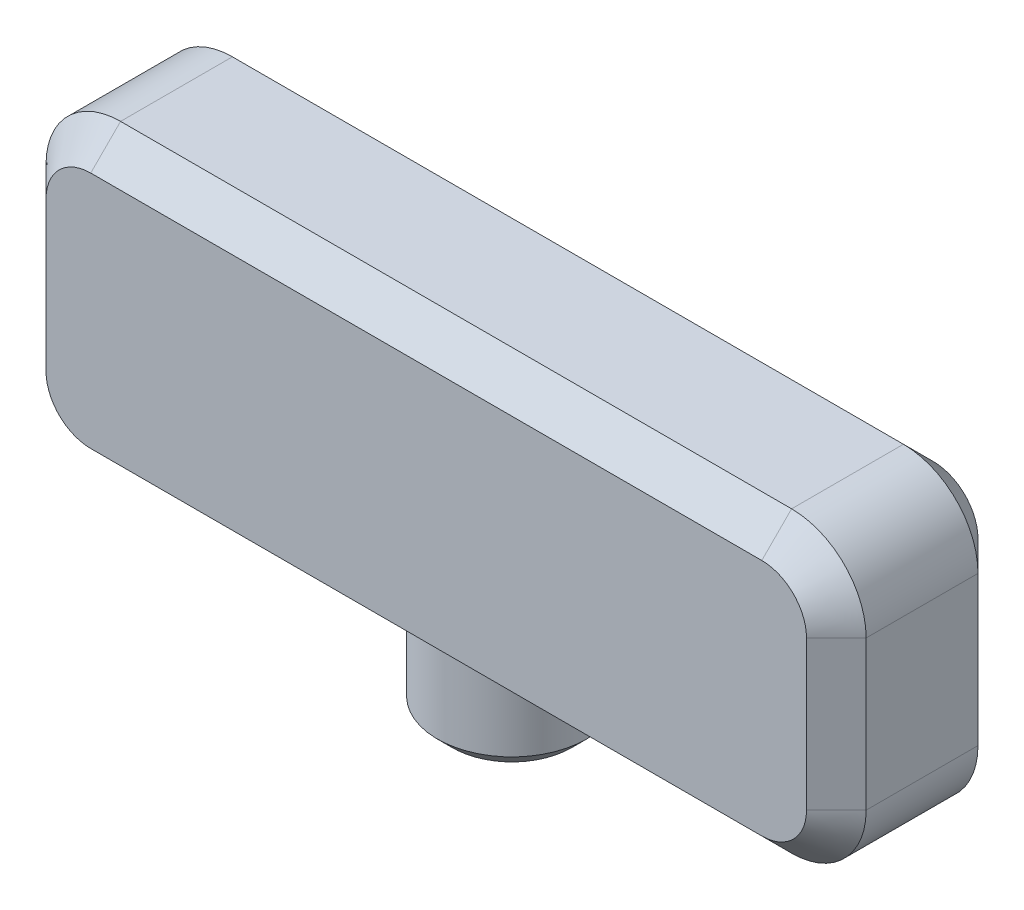
ISO-10303-21;
HEADER;
FILE_DESCRIPTION(('STEP AP214'),'2;1');
FILE_NAME('part.step','',(''),(''),'','','');
FILE_SCHEMA(('AUTOMOTIVE_DESIGN { 1 0 10303 214 1 1 1 1 }'));
ENDSEC;
DATA;
#1=APPLICATION_CONTEXT('core data for automotive mechanical design processes');
#2=APPLICATION_PROTOCOL_DEFINITION('international standard','automotive_design',2000,#1);
#3=PRODUCT_CONTEXT('',#1,'mechanical');
#4=PRODUCT('Part','Part','',(#3));
#5=PRODUCT_RELATED_PRODUCT_CATEGORY('part','',(#4));
#6=PRODUCT_DEFINITION_FORMATION('','',#4);
#7=PRODUCT_DEFINITION_CONTEXT('part definition',#1,'design');
#8=PRODUCT_DEFINITION('design','',#6,#7);
#9=PRODUCT_DEFINITION_SHAPE('','',#8);
#10=(LENGTH_UNIT() NAMED_UNIT(*) SI_UNIT(.MILLI.,.METRE.));
#11=(NAMED_UNIT(*) PLANE_ANGLE_UNIT() SI_UNIT($,.RADIAN.));
#12=(NAMED_UNIT(*) SI_UNIT($,.STERADIAN.) SOLID_ANGLE_UNIT());
#13=UNCERTAINTY_MEASURE_WITH_UNIT(LENGTH_MEASURE(1.E-05),#10,'distance_accuracy_value','');
#14=(GEOMETRIC_REPRESENTATION_CONTEXT(3) GLOBAL_UNCERTAINTY_ASSIGNED_CONTEXT((#13)) GLOBAL_UNIT_ASSIGNED_CONTEXT((#10,
#11,#12)) REPRESENTATION_CONTEXT('',''));
#15=CARTESIAN_POINT('',(0.,0.,0.));
#16=DIRECTION('',(0.,0.,1.));
#17=DIRECTION('',(1.,0.,0.));
#18=AXIS2_PLACEMENT_3D('',#15,#16,#17);
#19=CARTESIAN_POINT('',(0.,-25.4,22.86));
#20=DIRECTION('',(0.,-1.,0.));
#21=DIRECTION('',(1.,0.,0.));
#22=AXIS2_PLACEMENT_3D('',#19,#20,#21);
#23=PLANE('',#22);
#24=CARTESIAN_POINT('',(0.,-25.4,14.605));
#25=DIRECTION('',(0.,-1.,0.));
#26=DIRECTION('',(1.,0.,0.));
#27=AXIS2_PLACEMENT_3D('',#24,#25,#26);
#28=CIRCLE('',#27,12.7);
#29=CARTESIAN_POINT('',(-8.40026041263012,-25.4,24.13));
#30=VERTEX_POINT('',#29);
#31=CARTESIAN_POINT('',(-8.40026041263009,-25.4,5.08));
#32=VERTEX_POINT('',#31);
#33=EDGE_CURVE('E31',#30,#32,#28,.T.);
#34=ORIENTED_EDGE('',*,*,#33,.F.);
#35=DIRECTION('',(-1.,0.,0.));
#36=VECTOR('',#35,1.);
#37=CARTESIAN_POINT('',(0.,-25.4,24.13));
#38=LINE('',#37,#36);
#39=CARTESIAN_POINT('',(-57.15,-25.4,24.13));
#40=VERTEX_POINT('',#39);
#41=EDGE_CURVE('E261',#30,#40,#38,.T.);
#42=ORIENTED_EDGE('',*,*,#41,.T.);
#43=DIRECTION('',(0.,0.,-1.));
#44=VECTOR('',#43,1.);
#45=CARTESIAN_POINT('',(-57.15,-25.4,22.86));
#46=LINE('',#45,#44);
#47=CARTESIAN_POINT('',(-57.15,-25.4,5.08));
#48=VERTEX_POINT('',#47);
#49=EDGE_CURVE('E318',#40,#48,#46,.T.);
#50=ORIENTED_EDGE('',*,*,#49,.T.);
#51=DIRECTION('',(1.,0.,0.));
#52=VECTOR('',#51,1.);
#53=CARTESIAN_POINT('',(57.15,-25.4,5.08));
#54=LINE('',#53,#52);
#55=EDGE_CURVE('E154',#48,#32,#54,.T.);
#56=ORIENTED_EDGE('',*,*,#55,.T.);
#57=EDGE_LOOP('',(#34,#42,#50,#56));
#58=FACE_BOUND('',#57,.T.);
#59=ADVANCED_FACE('F16',(#58),#23,.T.);
#60=CARTESIAN_POINT('',(-69.85,0.,22.86));
#61=DIRECTION('',(-1.,0.,0.));
#62=DIRECTION('',(0.,0.,1.));
#63=AXIS2_PLACEMENT_3D('',#60,#61,#62);
#64=PLANE('',#63);
#65=DIRECTION('',(0.,0.,-1.));
#66=VECTOR('',#65,1.);
#67=CARTESIAN_POINT('',(-69.85,-12.7,22.86));
#68=LINE('',#67,#66);
#69=CARTESIAN_POINT('',(-69.85,-12.7,5.08));
#70=VERTEX_POINT('',#69);
#71=CARTESIAN_POINT('',(-69.85,-12.7,24.13));
#72=VERTEX_POINT('',#71);
#73=EDGE_CURVE('E312',#70,#72,#68,.F.);
#74=ORIENTED_EDGE('',*,*,#73,.T.);
#75=DIRECTION('',(0.,1.,0.));
#76=VECTOR('',#75,1.);
#77=CARTESIAN_POINT('',(-69.85,0.,24.13));
#78=LINE('',#77,#76);
#79=CARTESIAN_POINT('',(-69.85,12.7,24.13));
#80=VERTEX_POINT('',#79);
#81=EDGE_CURVE('E253',#72,#80,#78,.T.);
#82=ORIENTED_EDGE('',*,*,#81,.T.);
#83=DIRECTION('',(0.,0.,-1.));
#84=VECTOR('',#83,1.);
#85=CARTESIAN_POINT('',(-69.85,12.7,0.));
#86=LINE('',#85,#84);
#87=CARTESIAN_POINT('',(-69.85,12.7,5.08));
#88=VERTEX_POINT('',#87);
#89=EDGE_CURVE('E315',#80,#88,#86,.T.);
#90=ORIENTED_EDGE('',*,*,#89,.T.);
#91=DIRECTION('',(0.,-1.,0.));
#92=VECTOR('',#91,1.);
#93=CARTESIAN_POINT('',(-69.85,-12.7,5.08));
#94=LINE('',#93,#92);
#95=EDGE_CURVE('E255',#88,#70,#94,.T.);
#96=ORIENTED_EDGE('',*,*,#95,.T.);
#97=EDGE_LOOP('',(#74,#82,#90,#96));
#98=FACE_BOUND('',#97,.T.);
#99=ADVANCED_FACE('F360',(#98),#64,.T.);
#100=CARTESIAN_POINT('',(8.40026041263009,-25.4,5.08));
#101=VERTEX_POINT('',#100);
#102=CARTESIAN_POINT('',(8.40026041263012,-25.4,24.13));
#103=VERTEX_POINT('',#102);
#104=EDGE_CURVE('E158',#101,#103,#28,.T.);
#105=ORIENTED_EDGE('',*,*,#104,.F.);
#106=CARTESIAN_POINT('',(57.15,-25.4,5.08));
#107=VERTEX_POINT('',#106);
#108=EDGE_CURVE('E142',#101,#107,#54,.T.);
#109=ORIENTED_EDGE('',*,*,#108,.T.);
#110=DIRECTION('',(0.,0.,-1.));
#111=VECTOR('',#110,1.);
#112=CARTESIAN_POINT('',(57.15,-25.4,29.21));
#113=LINE('',#112,#111);
#114=CARTESIAN_POINT('',(57.15,-25.4,24.13));
#115=VERTEX_POINT('',#114);
#116=EDGE_CURVE('E321',#107,#115,#113,.F.);
#117=ORIENTED_EDGE('',*,*,#116,.T.);
#118=EDGE_CURVE('E160',#115,#103,#38,.T.);
#119=ORIENTED_EDGE('',*,*,#118,.T.);
#120=EDGE_LOOP('',(#105,#109,#117,#119));
#121=FACE_BOUND('',#120,.T.);
#122=ADVANCED_FACE('F159',(#121),#23,.T.);
#123=CARTESIAN_POINT('',(69.85,0.,22.86));
#124=DIRECTION('',(-1.,0.,0.));
#125=DIRECTION('',(0.,-1.,0.));
#126=AXIS2_PLACEMENT_3D('',#123,#124,#125);
#127=PLANE('',#126);
#128=DIRECTION('',(0.,0.,-1.));
#129=VECTOR('',#128,1.);
#130=CARTESIAN_POINT('',(69.85,12.7,22.86));
#131=LINE('',#130,#129);
#132=CARTESIAN_POINT('',(69.85,12.7,5.08));
#133=VERTEX_POINT('',#132);
#134=CARTESIAN_POINT('',(69.85,12.7,24.13));
#135=VERTEX_POINT('',#134);
#136=EDGE_CURVE('E309',#133,#135,#131,.F.);
#137=ORIENTED_EDGE('',*,*,#136,.T.);
#138=DIRECTION('',(0.,-1.,0.));
#139=VECTOR('',#138,1.);
#140=CARTESIAN_POINT('',(69.85,-12.7,24.13));
#141=LINE('',#140,#139);
#142=CARTESIAN_POINT('',(69.85,-12.7,24.13));
#143=VERTEX_POINT('',#142);
#144=EDGE_CURVE('E266',#135,#143,#141,.T.);
#145=ORIENTED_EDGE('',*,*,#144,.T.);
#146=DIRECTION('',(0.,0.,-1.));
#147=VECTOR('',#146,1.);
#148=CARTESIAN_POINT('',(69.85,-12.7,0.));
#149=LINE('',#148,#147);
#150=CARTESIAN_POINT('',(69.85,-12.7,5.08));
#151=VERTEX_POINT('',#150);
#152=EDGE_CURVE('E306',#143,#151,#149,.T.);
#153=ORIENTED_EDGE('',*,*,#152,.T.);
#154=DIRECTION('',(0.,1.,0.));
#155=VECTOR('',#154,1.);
#156=CARTESIAN_POINT('',(69.85,0.,5.08));
#157=LINE('',#156,#155);
#158=EDGE_CURVE('E268',#151,#133,#157,.T.);
#159=ORIENTED_EDGE('',*,*,#158,.T.);
#160=EDGE_LOOP('',(#137,#145,#153,#159));
#161=FACE_BOUND('',#160,.T.);
#162=ADVANCED_FACE('F370',(#161),#127,.F.);
#163=CARTESIAN_POINT('',(0.,25.4,22.86));
#164=DIRECTION('',(0.,-1.,0.));
#165=DIRECTION('',(1.,0.,0.));
#166=AXIS2_PLACEMENT_3D('',#163,#164,#165);
#167=PLANE('',#166);
#168=DIRECTION('',(0.,0.,-1.));
#169=VECTOR('',#168,1.);
#170=CARTESIAN_POINT('',(-57.15,25.4,29.21));
#171=LINE('',#170,#169);
#172=CARTESIAN_POINT('',(-57.15,25.4,5.08));
#173=VERTEX_POINT('',#172);
#174=CARTESIAN_POINT('',(-57.15,25.4,24.13));
#175=VERTEX_POINT('',#174);
#176=EDGE_CURVE('E303',#173,#175,#171,.F.);
#177=ORIENTED_EDGE('',*,*,#176,.T.);
#178=DIRECTION('',(1.,0.,0.));
#179=VECTOR('',#178,1.);
#180=CARTESIAN_POINT('',(57.15,25.4,24.13));
#181=LINE('',#180,#179);
#182=CARTESIAN_POINT('',(57.15,25.4,24.13));
#183=VERTEX_POINT('',#182);
#184=EDGE_CURVE('E274',#175,#183,#181,.T.);
#185=ORIENTED_EDGE('',*,*,#184,.T.);
#186=DIRECTION('',(0.,0.,-1.));
#187=VECTOR('',#186,1.);
#188=CARTESIAN_POINT('',(57.15,25.4,22.86));
#189=LINE('',#188,#187);
#190=CARTESIAN_POINT('',(57.15,25.4,5.08));
#191=VERTEX_POINT('',#190);
#192=EDGE_CURVE('E300',#183,#191,#189,.T.);
#193=ORIENTED_EDGE('',*,*,#192,.T.);
#194=DIRECTION('',(-1.,0.,0.));
#195=VECTOR('',#194,1.);
#196=CARTESIAN_POINT('',(0.,25.4,5.08));
#197=LINE('',#196,#195);
#198=EDGE_CURVE('E276',#191,#173,#197,.T.);
#199=ORIENTED_EDGE('',*,*,#198,.T.);
#200=EDGE_LOOP('',(#177,#185,#193,#199));
#201=FACE_BOUND('',#200,.T.);
#202=ADVANCED_FACE('F375',(#201),#167,.F.);
#203=CARTESIAN_POINT('',(0.,0.,0.));
#204=DIRECTION('',(0.,0.,1.));
#205=DIRECTION('',(1.,0.,0.));
#206=AXIS2_PLACEMENT_3D('',#203,#204,#205);
#207=PLANE('',#206);
#208=CARTESIAN_POINT('',(57.15,-12.7,0.));
#209=DIRECTION('',(0.,0.,1.));
#210=DIRECTION('',(1.,0.,0.));
#211=AXIS2_PLACEMENT_3D('',#208,#209,#210);
#212=CIRCLE('',#211,7.62);
#213=CARTESIAN_POINT('',(64.77,-12.7,0.));
#214=VERTEX_POINT('',#213);
#215=CARTESIAN_POINT('',(57.15,-20.32,0.));
#216=VERTEX_POINT('',#215);
#217=EDGE_CURVE('E239',#214,#216,#212,.F.);
#218=ORIENTED_EDGE('',*,*,#217,.T.);
#219=DIRECTION('',(-1.,0.,0.));
#220=VECTOR('',#219,1.);
#221=CARTESIAN_POINT('',(-57.15,-20.32,0.));
#222=LINE('',#221,#220);
#223=CARTESIAN_POINT('',(-57.15,-20.32,0.));
#224=VERTEX_POINT('',#223);
#225=EDGE_CURVE('E192',#216,#224,#222,.T.);
#226=ORIENTED_EDGE('',*,*,#225,.T.);
#227=CARTESIAN_POINT('',(-57.15,-12.7,0.));
#228=DIRECTION('',(0.,0.,1.));
#229=DIRECTION('',(1.,0.,0.));
#230=AXIS2_PLACEMENT_3D('',#227,#228,#229);
#231=CIRCLE('',#230,7.62);
#232=CARTESIAN_POINT('',(-64.77,-12.7,0.));
#233=VERTEX_POINT('',#232);
#234=EDGE_CURVE('E241',#224,#233,#231,.F.);
#235=ORIENTED_EDGE('',*,*,#234,.T.);
#236=DIRECTION('',(0.,1.,0.));
#237=VECTOR('',#236,1.);
#238=CARTESIAN_POINT('',(-64.77,12.7,0.));
#239=LINE('',#238,#237);
#240=CARTESIAN_POINT('',(-64.77,12.7,0.));
#241=VERTEX_POINT('',#240);
#242=EDGE_CURVE('E245',#233,#241,#239,.T.);
#243=ORIENTED_EDGE('',*,*,#242,.T.);
#244=CARTESIAN_POINT('',(-57.15,12.7,0.));
#245=DIRECTION('',(0.,0.,1.));
#246=DIRECTION('',(1.,0.,0.));
#247=AXIS2_PLACEMENT_3D('',#244,#245,#246);
#248=CIRCLE('',#247,7.62);
#249=CARTESIAN_POINT('',(-57.15,20.32,0.));
#250=VERTEX_POINT('',#249);
#251=EDGE_CURVE('E249',#241,#250,#248,.F.);
#252=ORIENTED_EDGE('',*,*,#251,.T.);
#253=DIRECTION('',(1.,0.,0.));
#254=VECTOR('',#253,1.);
#255=CARTESIAN_POINT('',(0.,20.32,0.));
#256=LINE('',#255,#254);
#257=CARTESIAN_POINT('',(57.15,20.32,0.));
#258=VERTEX_POINT('',#257);
#259=EDGE_CURVE('E251',#250,#258,#256,.T.);
#260=ORIENTED_EDGE('',*,*,#259,.T.);
#261=CARTESIAN_POINT('',(57.15,12.7,0.));
#262=DIRECTION('',(0.,0.,1.));
#263=DIRECTION('',(1.,0.,0.));
#264=AXIS2_PLACEMENT_3D('',#261,#262,#263);
#265=CIRCLE('',#264,7.62);
#266=CARTESIAN_POINT('',(64.77,12.7,0.));
#267=VERTEX_POINT('',#266);
#268=EDGE_CURVE('E247',#258,#267,#265,.F.);
#269=ORIENTED_EDGE('',*,*,#268,.T.);
#270=DIRECTION('',(0.,-1.,0.));
#271=VECTOR('',#270,1.);
#272=CARTESIAN_POINT('',(64.77,0.,0.));
#273=LINE('',#272,#271);
#274=EDGE_CURVE('E243',#267,#214,#273,.T.);
#275=ORIENTED_EDGE('',*,*,#274,.T.);
#276=EDGE_LOOP('',(#218,#226,#235,#243,#252,#260,#269,#275));
#277=FACE_BOUND('',#276,.T.);
#278=CARTESIAN_POINT('',(-44.45,0.,0.));
#279=DIRECTION('',(0.,0.,1.));
#280=DIRECTION('',(1.,0.,0.));
#281=AXIS2_PLACEMENT_3D('',#278,#279,#280);
#282=CIRCLE('',#281,13.335);
#283=CARTESIAN_POINT('',(-31.115,0.,0.));
#284=VERTEX_POINT('',#283);
#285=EDGE_CURVE('E218',#284,#284,#282,.T.);
#286=ORIENTED_EDGE('',*,*,#285,.T.);
#287=EDGE_LOOP('',(#286));
#288=FACE_BOUND('',#287,.T.);
#289=CARTESIAN_POINT('',(44.45,0.,0.));
#290=DIRECTION('',(0.,0.,1.));
#291=DIRECTION('',(1.,0.,0.));
#292=AXIS2_PLACEMENT_3D('',#289,#290,#291);
#293=CIRCLE('',#292,13.335);
#294=CARTESIAN_POINT('',(57.785,0.,0.));
#295=VERTEX_POINT('',#294);
#296=EDGE_CURVE('E327',#295,#295,#293,.T.);
#297=ORIENTED_EDGE('',*,*,#296,.T.);
#298=EDGE_LOOP('',(#297));
#299=FACE_BOUND('',#298,.T.);
#300=ADVANCED_FACE('F381',(#277,#288,#299),#207,.F.);
#301=CARTESIAN_POINT('',(0.,0.,29.21));
#302=DIRECTION('',(0.,0.,1.));
#303=DIRECTION('',(1.,0.,0.));
#304=AXIS2_PLACEMENT_3D('',#301,#302,#303);
#305=PLANE('',#304);
#306=DIRECTION('',(-1.,0.,0.));
#307=VECTOR('',#306,1.);
#308=CARTESIAN_POINT('',(-57.15,20.32,29.21));
#309=LINE('',#308,#307);
#310=CARTESIAN_POINT('',(57.15,20.32,29.21));
#311=VERTEX_POINT('',#310);
#312=CARTESIAN_POINT('',(-57.15,20.32,29.21));
#313=VERTEX_POINT('',#312);
#314=EDGE_CURVE('E286',#311,#313,#309,.T.);
#315=ORIENTED_EDGE('',*,*,#314,.T.);
#316=CARTESIAN_POINT('',(-57.15,12.7,29.21));
#317=DIRECTION('',(0.,0.,1.));
#318=DIRECTION('',(1.,0.,0.));
#319=AXIS2_PLACEMENT_3D('',#316,#317,#318);
#320=CIRCLE('',#319,7.62);
#321=CARTESIAN_POINT('',(-64.77,12.7,29.21));
#322=VERTEX_POINT('',#321);
#323=EDGE_CURVE('E283',#313,#322,#320,.T.);
#324=ORIENTED_EDGE('',*,*,#323,.T.);
#325=DIRECTION('',(0.,-1.,0.));
#326=VECTOR('',#325,1.);
#327=CARTESIAN_POINT('',(-64.77,0.,29.21));
#328=LINE('',#327,#326);
#329=CARTESIAN_POINT('',(-64.77,-12.7,29.21));
#330=VERTEX_POINT('',#329);
#331=EDGE_CURVE('E298',#322,#330,#328,.T.);
#332=ORIENTED_EDGE('',*,*,#331,.T.);
#333=CARTESIAN_POINT('',(-57.15,-12.7,29.21));
#334=DIRECTION('',(0.,0.,1.));
#335=DIRECTION('',(1.,0.,0.));
#336=AXIS2_PLACEMENT_3D('',#333,#334,#335);
#337=CIRCLE('',#336,7.62);
#338=CARTESIAN_POINT('',(-57.15,-20.32,29.21));
#339=VERTEX_POINT('',#338);
#340=EDGE_CURVE('E296',#330,#339,#337,.T.);
#341=ORIENTED_EDGE('',*,*,#340,.T.);
#342=DIRECTION('',(1.,0.,0.));
#343=VECTOR('',#342,1.);
#344=CARTESIAN_POINT('',(0.,-20.32,29.21));
#345=LINE('',#344,#343);
#346=CARTESIAN_POINT('',(57.15,-20.32,29.21));
#347=VERTEX_POINT('',#346);
#348=EDGE_CURVE('E294',#339,#347,#345,.T.);
#349=ORIENTED_EDGE('',*,*,#348,.T.);
#350=CARTESIAN_POINT('',(57.15,-12.7,29.21));
#351=DIRECTION('',(0.,0.,1.));
#352=DIRECTION('',(1.,0.,0.));
#353=AXIS2_PLACEMENT_3D('',#350,#351,#352);
#354=CIRCLE('',#353,7.62);
#355=CARTESIAN_POINT('',(64.77,-12.7,29.21));
#356=VERTEX_POINT('',#355);
#357=EDGE_CURVE('E292',#347,#356,#354,.T.);
#358=ORIENTED_EDGE('',*,*,#357,.T.);
#359=DIRECTION('',(0.,1.,0.));
#360=VECTOR('',#359,1.);
#361=CARTESIAN_POINT('',(64.77,12.7,29.21));
#362=LINE('',#361,#360);
#363=CARTESIAN_POINT('',(64.77,12.7,29.21));
#364=VERTEX_POINT('',#363);
#365=EDGE_CURVE('E290',#356,#364,#362,.T.);
#366=ORIENTED_EDGE('',*,*,#365,.T.);
#367=CARTESIAN_POINT('',(57.15,12.7,29.21));
#368=DIRECTION('',(0.,0.,1.));
#369=DIRECTION('',(1.,0.,0.));
#370=AXIS2_PLACEMENT_3D('',#367,#368,#369);
#371=CIRCLE('',#370,7.62);
#372=EDGE_CURVE('E288',#364,#311,#371,.T.);
#373=ORIENTED_EDGE('',*,*,#372,.T.);
#374=EDGE_LOOP('',(#315,#324,#332,#341,#349,#358,#366,#373));
#375=FACE_BOUND('',#374,.T.);
#376=ADVANCED_FACE('F387',(#375),#305,.T.);
#377=CARTESIAN_POINT('',(44.45,0.,-7.62));
#378=DIRECTION('',(0.,0.,1.));
#379=DIRECTION('',(1.,0.,0.));
#380=AXIS2_PLACEMENT_3D('',#377,#378,#379);
#381=CYLINDRICAL_SURFACE('',#380,13.335);
#382=CARTESIAN_POINT('',(44.45,0.,-5.07999999999992));
#383=DIRECTION('',(0.,0.,1.));
#384=DIRECTION('',(1.,0.,0.));
#385=AXIS2_PLACEMENT_3D('',#382,#383,#384);
#386=CIRCLE('',#385,13.335);
#387=CARTESIAN_POINT('',(57.785,0.,-5.07999999999992));
#388=VERTEX_POINT('',#387);
#389=EDGE_CURVE('E189',#388,#388,#386,.T.);
#390=ORIENTED_EDGE('',*,*,#389,.T.);
#391=EDGE_LOOP('',(#390));
#392=FACE_BOUND('',#391,.T.);
#393=ORIENTED_EDGE('',*,*,#296,.F.);
#394=EDGE_LOOP('',(#393));
#395=FACE_BOUND('',#394,.T.);
#396=ADVANCED_FACE('F398',(#392,#395),#381,.T.);
#397=CARTESIAN_POINT('',(44.45,0.,-7.62));
#398=DIRECTION('',(0.,0.,1.));
#399=DIRECTION('',(1.,0.,0.));
#400=AXIS2_PLACEMENT_3D('',#397,#398,#399);
#401=PLANE('',#400);
#402=CARTESIAN_POINT('',(44.45,0.,-7.62));
#403=DIRECTION('',(0.,0.,1.));
#404=DIRECTION('',(1.,0.,0.));
#405=AXIS2_PLACEMENT_3D('',#402,#403,#404);
#406=CIRCLE('',#405,10.795);
#407=CARTESIAN_POINT('',(55.245,0.,-7.62));
#408=VERTEX_POINT('',#407);
#409=EDGE_CURVE('E183',#408,#408,#406,.F.);
#410=ORIENTED_EDGE('',*,*,#409,.T.);
#411=EDGE_LOOP('',(#410));
#412=FACE_BOUND('',#411,.T.);
#413=CARTESIAN_POINT('',(44.45,0.,-7.62));
#414=DIRECTION('',(0.,0.,1.));
#415=DIRECTION('',(1.,0.,0.));
#416=AXIS2_PLACEMENT_3D('',#413,#414,#415);
#417=CIRCLE('',#416,8.255);
#418=CARTESIAN_POINT('',(52.705,0.,-7.62));
#419=VERTEX_POINT('',#418);
#420=EDGE_CURVE('E186',#419,#419,#417,.T.);
#421=ORIENTED_EDGE('',*,*,#420,.T.);
#422=EDGE_LOOP('',(#421));
#423=FACE_BOUND('',#422,.T.);
#424=ADVANCED_FACE('F402',(#412,#423),#401,.F.);
#425=CARTESIAN_POINT('',(0.,0.,22.86));
#426=DIRECTION('',(0.,0.,1.));
#427=DIRECTION('',(1.,0.,0.));
#428=AXIS2_PLACEMENT_3D('',#425,#426,#427);
#429=PLANE('',#428);
#430=CARTESIAN_POINT('',(44.45,0.,22.86));
#431=DIRECTION('',(0.,0.,1.));
#432=DIRECTION('',(1.,0.,0.));
#433=AXIS2_PLACEMENT_3D('',#430,#431,#432);
#434=CIRCLE('',#433,5.715);
#435=CARTESIAN_POINT('',(50.165,0.,22.86));
#436=VERTEX_POINT('',#435);
#437=EDGE_CURVE('E324',#436,#436,#434,.T.);
#438=ORIENTED_EDGE('',*,*,#437,.F.);
#439=EDGE_LOOP('',(#438));
#440=FACE_BOUND('',#439,.T.);
#441=ADVANCED_FACE('F395',(#440),#429,.F.);
#442=CARTESIAN_POINT('',(44.45,0.,22.86));
#443=DIRECTION('',(0.,0.,-1.));
#444=DIRECTION('',(-1.,0.,0.));
#445=AXIS2_PLACEMENT_3D('',#442,#443,#444);
#446=CYLINDRICAL_SURFACE('',#445,5.715);
#447=CARTESIAN_POINT('',(44.45,0.,-5.08));
#448=DIRECTION('',(0.,0.,1.));
#449=DIRECTION('',(1.,0.,0.));
#450=AXIS2_PLACEMENT_3D('',#447,#448,#449);
#451=CIRCLE('',#450,5.715);
#452=CARTESIAN_POINT('',(50.165,0.,-5.08));
#453=VERTEX_POINT('',#452);
#454=EDGE_CURVE('E165',#453,#453,#451,.F.);
#455=ORIENTED_EDGE('',*,*,#454,.T.);
#456=EDGE_LOOP('',(#455));
#457=FACE_BOUND('',#456,.T.);
#458=ORIENTED_EDGE('',*,*,#437,.T.);
#459=EDGE_LOOP('',(#458));
#460=FACE_BOUND('',#459,.T.);
#461=ADVANCED_FACE('F412',(#457,#460),#446,.F.);
#462=CARTESIAN_POINT('',(-44.45,0.,-7.62));
#463=DIRECTION('',(0.,0.,1.));
#464=DIRECTION('',(1.,0.,0.));
#465=AXIS2_PLACEMENT_3D('',#462,#463,#464);
#466=CYLINDRICAL_SURFACE('',#465,13.335);
#467=CARTESIAN_POINT('',(-44.45,0.,-5.07999999999992));
#468=DIRECTION('',(0.,0.,1.));
#469=DIRECTION('',(1.,0.,0.));
#470=AXIS2_PLACEMENT_3D('',#467,#468,#469);
#471=CIRCLE('',#470,13.335);
#472=CARTESIAN_POINT('',(-31.115,0.,-5.07999999999992));
#473=VERTEX_POINT('',#472);
#474=EDGE_CURVE('E180',#473,#473,#471,.T.);
#475=ORIENTED_EDGE('',*,*,#474,.T.);
#476=EDGE_LOOP('',(#475));
#477=FACE_BOUND('',#476,.T.);
#478=ORIENTED_EDGE('',*,*,#285,.F.);
#479=EDGE_LOOP('',(#478));
#480=FACE_BOUND('',#479,.T.);
#481=ADVANCED_FACE('F409',(#477,#480),#466,.T.);
#482=CARTESIAN_POINT('',(-44.45,0.,-7.62));
#483=DIRECTION('',(0.,0.,1.));
#484=DIRECTION('',(1.,0.,0.));
#485=AXIS2_PLACEMENT_3D('',#482,#483,#484);
#486=PLANE('',#485);
#487=CARTESIAN_POINT('',(-44.45,0.,-7.62));
#488=DIRECTION('',(0.,0.,1.));
#489=DIRECTION('',(1.,0.,0.));
#490=AXIS2_PLACEMENT_3D('',#487,#488,#489);
#491=CIRCLE('',#490,10.795);
#492=CARTESIAN_POINT('',(-33.655,0.,-7.62));
#493=VERTEX_POINT('',#492);
#494=EDGE_CURVE('E174',#493,#493,#491,.F.);
#495=ORIENTED_EDGE('',*,*,#494,.T.);
#496=EDGE_LOOP('',(#495));
#497=FACE_BOUND('',#496,.T.);
#498=CARTESIAN_POINT('',(-44.45,0.,-7.62));
#499=DIRECTION('',(0.,0.,1.));
#500=DIRECTION('',(1.,0.,0.));
#501=AXIS2_PLACEMENT_3D('',#498,#499,#500);
#502=CIRCLE('',#501,8.255);
#503=CARTESIAN_POINT('',(-36.195,0.,-7.62));
#504=VERTEX_POINT('',#503);
#505=EDGE_CURVE('E177',#504,#504,#502,.T.);
#506=ORIENTED_EDGE('',*,*,#505,.T.);
#507=EDGE_LOOP('',(#506));
#508=FACE_BOUND('',#507,.T.);
#509=ADVANCED_FACE('F393',(#497,#508),#486,.F.);
#510=CARTESIAN_POINT('',(-44.45,0.,22.86));
#511=DIRECTION('',(0.,0.,1.));
#512=DIRECTION('',(1.,0.,0.));
#513=AXIS2_PLACEMENT_3D('',#510,#511,#512);
#514=CIRCLE('',#513,5.715);
#515=CARTESIAN_POINT('',(-38.735,0.,22.86));
#516=VERTEX_POINT('',#515);
#517=EDGE_CURVE('E323',#516,#516,#514,.T.);
#518=ORIENTED_EDGE('',*,*,#517,.F.);
#519=EDGE_LOOP('',(#518));
#520=FACE_BOUND('',#519,.T.);
#521=ADVANCED_FACE('F389',(#520),#429,.F.);
#522=CARTESIAN_POINT('',(-44.45,0.,22.86));
#523=DIRECTION('',(0.,0.,-1.));
#524=DIRECTION('',(-1.,0.,0.));
#525=AXIS2_PLACEMENT_3D('',#522,#523,#524);
#526=CYLINDRICAL_SURFACE('',#525,5.715);
#527=CARTESIAN_POINT('',(-44.45,0.,-5.08));
#528=DIRECTION('',(0.,0.,1.));
#529=DIRECTION('',(1.,0.,0.));
#530=AXIS2_PLACEMENT_3D('',#527,#528,#529);
#531=CIRCLE('',#530,5.715);
#532=CARTESIAN_POINT('',(-38.735,0.,-5.08));
#533=VERTEX_POINT('',#532);
#534=EDGE_CURVE('E169',#533,#533,#531,.F.);
#535=ORIENTED_EDGE('',*,*,#534,.T.);
#536=EDGE_LOOP('',(#535));
#537=FACE_BOUND('',#536,.T.);
#538=ORIENTED_EDGE('',*,*,#517,.T.);
#539=EDGE_LOOP('',(#538));
#540=FACE_BOUND('',#539,.T.);
#541=ADVANCED_FACE('F392',(#537,#540),#526,.F.);
#542=CARTESIAN_POINT('',(-57.15,-12.7,22.86));
#543=DIRECTION('',(0.,0.,-1.));
#544=DIRECTION('',(-1.,0.,0.));
#545=AXIS2_PLACEMENT_3D('',#542,#543,#544);
#546=CYLINDRICAL_SURFACE('',#545,12.7);
#547=ORIENTED_EDGE('',*,*,#49,.F.);
#548=CARTESIAN_POINT('',(-57.15,-12.7,24.13));
#549=DIRECTION('',(0.,0.,1.));
#550=DIRECTION('',(1.,0.,0.));
#551=AXIS2_PLACEMENT_3D('',#548,#549,#550);
#552=CIRCLE('',#551,12.7);
#553=EDGE_CURVE('E257',#40,#72,#552,.F.);
#554=ORIENTED_EDGE('',*,*,#553,.T.);
#555=ORIENTED_EDGE('',*,*,#73,.F.);
#556=CARTESIAN_POINT('',(-57.15,-12.7,5.08));
#557=DIRECTION('',(0.,0.,1.));
#558=DIRECTION('',(1.,0.,0.));
#559=AXIS2_PLACEMENT_3D('',#556,#557,#558);
#560=CIRCLE('',#559,12.7);
#561=EDGE_CURVE('E259',#70,#48,#560,.T.);
#562=ORIENTED_EDGE('',*,*,#561,.T.);
#563=EDGE_LOOP('',(#547,#554,#555,#562));
#564=FACE_BOUND('',#563,.T.);
#565=ADVANCED_FACE('F717',(#564),#546,.T.);
#566=CARTESIAN_POINT('',(57.15,-12.7,22.86));
#567=DIRECTION('',(0.,0.,1.));
#568=DIRECTION('',(1.,0.,0.));
#569=AXIS2_PLACEMENT_3D('',#566,#567,#568);
#570=CYLINDRICAL_SURFACE('',#569,12.7);
#571=ORIENTED_EDGE('',*,*,#152,.F.);
#572=CARTESIAN_POINT('',(57.15,-12.7,24.13));
#573=DIRECTION('',(0.,0.,1.));
#574=DIRECTION('',(1.,0.,0.));
#575=AXIS2_PLACEMENT_3D('',#572,#573,#574);
#576=CIRCLE('',#575,12.7);
#577=EDGE_CURVE('E155',#143,#115,#576,.F.);
#578=ORIENTED_EDGE('',*,*,#577,.T.);
#579=ORIENTED_EDGE('',*,*,#116,.F.);
#580=CARTESIAN_POINT('',(57.15,-12.7,5.08));
#581=DIRECTION('',(0.,0.,1.));
#582=DIRECTION('',(1.,0.,0.));
#583=AXIS2_PLACEMENT_3D('',#580,#581,#582);
#584=CIRCLE('',#583,12.7);
#585=EDGE_CURVE('E264',#107,#151,#584,.T.);
#586=ORIENTED_EDGE('',*,*,#585,.T.);
#587=EDGE_LOOP('',(#571,#578,#579,#586));
#588=FACE_BOUND('',#587,.T.);
#589=ADVANCED_FACE('F707',(#588),#570,.T.);
#590=CARTESIAN_POINT('',(57.15,12.7,22.86));
#591=DIRECTION('',(0.,0.,-1.));
#592=DIRECTION('',(-1.,0.,0.));
#593=AXIS2_PLACEMENT_3D('',#590,#591,#592);
#594=CYLINDRICAL_SURFACE('',#593,12.7);
#595=ORIENTED_EDGE('',*,*,#192,.F.);
#596=CARTESIAN_POINT('',(57.15,12.7,24.13));
#597=DIRECTION('',(0.,0.,1.));
#598=DIRECTION('',(1.,0.,0.));
#599=AXIS2_PLACEMENT_3D('',#596,#597,#598);
#600=CIRCLE('',#599,12.7);
#601=EDGE_CURVE('E270',#183,#135,#600,.F.);
#602=ORIENTED_EDGE('',*,*,#601,.T.);
#603=ORIENTED_EDGE('',*,*,#136,.F.);
#604=CARTESIAN_POINT('',(57.15,12.7,5.08));
#605=DIRECTION('',(0.,0.,1.));
#606=DIRECTION('',(1.,0.,0.));
#607=AXIS2_PLACEMENT_3D('',#604,#605,#606);
#608=CIRCLE('',#607,12.7);
#609=EDGE_CURVE('E272',#133,#191,#608,.T.);
#610=ORIENTED_EDGE('',*,*,#609,.T.);
#611=EDGE_LOOP('',(#595,#602,#603,#610));
#612=FACE_BOUND('',#611,.T.);
#613=ADVANCED_FACE('F697',(#612),#594,.T.);
#614=CARTESIAN_POINT('',(-57.15,12.7,22.86));
#615=DIRECTION('',(0.,0.,1.));
#616=DIRECTION('',(1.,0.,0.));
#617=AXIS2_PLACEMENT_3D('',#614,#615,#616);
#618=CYLINDRICAL_SURFACE('',#617,12.7);
#619=ORIENTED_EDGE('',*,*,#89,.F.);
#620=CARTESIAN_POINT('',(-57.15,12.7,24.13));
#621=DIRECTION('',(0.,0.,1.));
#622=DIRECTION('',(1.,0.,0.));
#623=AXIS2_PLACEMENT_3D('',#620,#621,#622);
#624=CIRCLE('',#623,12.7);
#625=EDGE_CURVE('E278',#80,#175,#624,.F.);
#626=ORIENTED_EDGE('',*,*,#625,.T.);
#627=ORIENTED_EDGE('',*,*,#176,.F.);
#628=CARTESIAN_POINT('',(-57.15,12.7,5.08));
#629=DIRECTION('',(0.,0.,1.));
#630=DIRECTION('',(1.,0.,0.));
#631=AXIS2_PLACEMENT_3D('',#628,#629,#630);
#632=CIRCLE('',#631,12.7);
#633=EDGE_CURVE('E281',#173,#88,#632,.T.);
#634=ORIENTED_EDGE('',*,*,#633,.T.);
#635=EDGE_LOOP('',(#619,#626,#627,#634));
#636=FACE_BOUND('',#635,.T.);
#637=ADVANCED_FACE('F687',(#636),#618,.T.);
#638=CARTESIAN_POINT('',(57.15,-12.7,29.21));
#639=DIRECTION('',(0.,0.,-1.));
#640=DIRECTION('',(-1.,0.,0.));
#641=AXIS2_PLACEMENT_3D('',#638,#639,#640);
#642=CONICAL_SURFACE('',#641,7.62,0.785398163397448);
#643=DIRECTION('',(0.,0.707106781186546,0.707106781186549));
#644=VECTOR('',#643,1.);
#645=CARTESIAN_POINT('',(57.15,-25.4,24.13));
#646=LINE('',#645,#644);
#647=EDGE_CURVE('E219',#115,#347,#646,.T.);
#648=ORIENTED_EDGE('',*,*,#647,.F.);
#649=ORIENTED_EDGE('',*,*,#577,.F.);
#650=DIRECTION('',(0.707106781186547,0.,-0.707106781186549));
#651=VECTOR('',#650,1.);
#652=CARTESIAN_POINT('',(64.77,-12.7,29.21));
#653=LINE('',#652,#651);
#654=EDGE_CURVE('E215',#356,#143,#653,.T.);
#655=ORIENTED_EDGE('',*,*,#654,.F.);
#656=ORIENTED_EDGE('',*,*,#357,.F.);
#657=EDGE_LOOP('',(#648,#649,#655,#656));
#658=FACE_BOUND('',#657,.T.);
#659=ADVANCED_FACE('F677',(#658),#642,.T.);
#660=CARTESIAN_POINT('',(69.85,0.,24.13));
#661=DIRECTION('',(0.707106781186549,0.,0.707106781186547));
#662=DIRECTION('',(0.,1.,0.));
#663=AXIS2_PLACEMENT_3D('',#660,#661,#662);
#664=PLANE('',#663);
#665=ORIENTED_EDGE('',*,*,#654,.T.);
#666=ORIENTED_EDGE('',*,*,#144,.F.);
#667=DIRECTION('',(0.707106781186547,0.,-0.707106781186549));
#668=VECTOR('',#667,1.);
#669=CARTESIAN_POINT('',(64.77,12.7,29.21));
#670=LINE('',#669,#668);
#671=EDGE_CURVE('E222',#364,#135,#670,.T.);
#672=ORIENTED_EDGE('',*,*,#671,.F.);
#673=ORIENTED_EDGE('',*,*,#365,.F.);
#674=EDGE_LOOP('',(#665,#666,#672,#673));
#675=FACE_BOUND('',#674,.T.);
#676=ADVANCED_FACE('F668',(#675),#664,.T.);
#677=CARTESIAN_POINT('',(0.,-20.32,29.21));
#678=DIRECTION('',(0.,0.707106781186549,-0.707106781186547));
#679=DIRECTION('',(1.,0.,0.));
#680=AXIS2_PLACEMENT_3D('',#677,#678,#679);
#681=PLANE('',#680);
#682=CARTESIAN_POINT('',(0.,-34.925,14.605));
#683=DIRECTION('',(0.,0.707106781186549,-0.707106781186547));
#684=DIRECTION('',(0.,-0.707106781186547,-0.707106781186549));
#685=AXIS2_PLACEMENT_3D('',#682,#683,#684);
#686=ELLIPSE('',#685,17.9605122421383,12.7);
#687=EDGE_CURVE('E38',#103,#30,#686,.F.);
#688=ORIENTED_EDGE('',*,*,#687,.F.);
#689=ORIENTED_EDGE('',*,*,#118,.F.);
#690=ORIENTED_EDGE('',*,*,#647,.T.);
#691=ORIENTED_EDGE('',*,*,#348,.F.);
#692=DIRECTION('',(0.,0.707106781186547,0.707106781186548));
#693=VECTOR('',#692,1.);
#694=CARTESIAN_POINT('',(-57.15,-25.4,24.13));
#695=LINE('',#694,#693);
#696=EDGE_CURVE('E225',#40,#339,#695,.T.);
#697=ORIENTED_EDGE('',*,*,#696,.F.);
#698=ORIENTED_EDGE('',*,*,#41,.F.);
#699=EDGE_LOOP('',(#688,#689,#690,#691,#697,#698));
#700=FACE_BOUND('',#699,.T.);
#701=ADVANCED_FACE('F658',(#700),#681,.F.);
#702=CARTESIAN_POINT('',(57.15,12.7,29.21));
#703=DIRECTION('',(0.,0.,-1.));
#704=DIRECTION('',(-1.,0.,0.));
#705=AXIS2_PLACEMENT_3D('',#702,#703,#704);
#706=CONICAL_SURFACE('',#705,7.62,0.785398163397448);
#707=ORIENTED_EDGE('',*,*,#671,.T.);
#708=ORIENTED_EDGE('',*,*,#601,.F.);
#709=DIRECTION('',(0.,0.707106781186547,-0.707106781186548));
#710=VECTOR('',#709,1.);
#711=CARTESIAN_POINT('',(57.15,20.32,29.21));
#712=LINE('',#711,#710);
#713=EDGE_CURVE('E228',#311,#183,#712,.T.);
#714=ORIENTED_EDGE('',*,*,#713,.F.);
#715=ORIENTED_EDGE('',*,*,#372,.F.);
#716=EDGE_LOOP('',(#707,#708,#714,#715));
#717=FACE_BOUND('',#716,.T.);
#718=ADVANCED_FACE('F648',(#717),#706,.T.);
#719=CARTESIAN_POINT('',(-57.15,-12.7,29.21));
#720=DIRECTION('',(0.,0.,-1.));
#721=DIRECTION('',(-1.,0.,0.));
#722=AXIS2_PLACEMENT_3D('',#719,#720,#721);
#723=CONICAL_SURFACE('',#722,7.62,0.785398163397447);
#724=ORIENTED_EDGE('',*,*,#696,.T.);
#725=ORIENTED_EDGE('',*,*,#340,.F.);
#726=DIRECTION('',(0.707106781186547,0.,0.707106781186549));
#727=VECTOR('',#726,1.);
#728=CARTESIAN_POINT('',(-69.85,-12.7,24.13));
#729=LINE('',#728,#727);
#730=EDGE_CURVE('E231',#72,#330,#729,.T.);
#731=ORIENTED_EDGE('',*,*,#730,.F.);
#732=ORIENTED_EDGE('',*,*,#553,.F.);
#733=EDGE_LOOP('',(#724,#725,#731,#732));
#734=FACE_BOUND('',#733,.T.);
#735=ADVANCED_FACE('F638',(#734),#723,.T.);
#736=CARTESIAN_POINT('',(0.,25.4,24.13));
#737=DIRECTION('',(0.,0.707106781186549,0.707106781186547));
#738=DIRECTION('',(-1.,0.,0.));
#739=AXIS2_PLACEMENT_3D('',#736,#737,#738);
#740=PLANE('',#739);
#741=ORIENTED_EDGE('',*,*,#713,.T.);
#742=ORIENTED_EDGE('',*,*,#184,.F.);
#743=DIRECTION('',(0.,0.707106781186547,-0.707106781186549));
#744=VECTOR('',#743,1.);
#745=CARTESIAN_POINT('',(-57.15,20.32,29.21));
#746=LINE('',#745,#744);
#747=EDGE_CURVE('E234',#313,#175,#746,.T.);
#748=ORIENTED_EDGE('',*,*,#747,.F.);
#749=ORIENTED_EDGE('',*,*,#314,.F.);
#750=EDGE_LOOP('',(#741,#742,#748,#749));
#751=FACE_BOUND('',#750,.T.);
#752=ADVANCED_FACE('F628',(#751),#740,.T.);
#753=CARTESIAN_POINT('',(-64.77,0.,29.21));
#754=DIRECTION('',(0.707106781186549,0.,-0.707106781186547));
#755=DIRECTION('',(0.,-1.,0.));
#756=AXIS2_PLACEMENT_3D('',#753,#754,#755);
#757=PLANE('',#756);
#758=ORIENTED_EDGE('',*,*,#730,.T.);
#759=ORIENTED_EDGE('',*,*,#331,.F.);
#760=DIRECTION('',(0.707106781186547,0.,0.707106781186549));
#761=VECTOR('',#760,1.);
#762=CARTESIAN_POINT('',(-69.85,12.7,24.13));
#763=LINE('',#762,#761);
#764=EDGE_CURVE('E196',#80,#322,#763,.T.);
#765=ORIENTED_EDGE('',*,*,#764,.F.);
#766=ORIENTED_EDGE('',*,*,#81,.F.);
#767=EDGE_LOOP('',(#758,#759,#765,#766));
#768=FACE_BOUND('',#767,.T.);
#769=ADVANCED_FACE('F618',(#768),#757,.F.);
#770=CARTESIAN_POINT('',(-57.15,12.7,29.21));
#771=DIRECTION('',(0.,0.,-1.));
#772=DIRECTION('',(-1.,0.,0.));
#773=AXIS2_PLACEMENT_3D('',#770,#771,#772);
#774=CONICAL_SURFACE('',#773,7.62,0.785398163397448);
#775=ORIENTED_EDGE('',*,*,#747,.T.);
#776=ORIENTED_EDGE('',*,*,#625,.F.);
#777=ORIENTED_EDGE('',*,*,#764,.T.);
#778=ORIENTED_EDGE('',*,*,#323,.F.);
#779=EDGE_LOOP('',(#775,#776,#777,#778));
#780=FACE_BOUND('',#779,.T.);
#781=ADVANCED_FACE('F609',(#780),#774,.T.);
#782=CARTESIAN_POINT('',(0.,25.4,5.08));
#783=DIRECTION('',(0.,-0.707106781186547,0.707106781186549));
#784=DIRECTION('',(-1.,0.,0.));
#785=AXIS2_PLACEMENT_3D('',#782,#783,#784);
#786=PLANE('',#785);
#787=DIRECTION('',(0.,-0.707106781186549,-0.707106781186546));
#788=VECTOR('',#787,1.);
#789=CARTESIAN_POINT('',(-57.15,25.4,5.08));
#790=LINE('',#789,#788);
#791=EDGE_CURVE('E197',#173,#250,#790,.T.);
#792=ORIENTED_EDGE('',*,*,#791,.F.);
#793=ORIENTED_EDGE('',*,*,#198,.F.);
#794=DIRECTION('',(0.,0.707106781186549,0.707106781186547));
#795=VECTOR('',#794,1.);
#796=CARTESIAN_POINT('',(57.15,20.32,0.));
#797=LINE('',#796,#795);
#798=EDGE_CURVE('E193',#258,#191,#797,.T.);
#799=ORIENTED_EDGE('',*,*,#798,.F.);
#800=ORIENTED_EDGE('',*,*,#259,.F.);
#801=EDGE_LOOP('',(#792,#793,#799,#800));
#802=FACE_BOUND('',#801,.T.);
#803=ADVANCED_FACE('F599',(#802),#786,.F.);
#804=CARTESIAN_POINT('',(57.15,12.7,0.));
#805=DIRECTION('',(0.,0.,1.));
#806=DIRECTION('',(1.,0.,0.));
#807=AXIS2_PLACEMENT_3D('',#804,#805,#806);
#808=CONICAL_SURFACE('',#807,7.62,0.78539816339745);
#809=ORIENTED_EDGE('',*,*,#798,.T.);
#810=ORIENTED_EDGE('',*,*,#609,.F.);
#811=DIRECTION('',(0.707106781186549,0.,0.707106781186547));
#812=VECTOR('',#811,1.);
#813=CARTESIAN_POINT('',(64.77,12.7,0.));
#814=LINE('',#813,#812);
#815=EDGE_CURVE('E200',#267,#133,#814,.T.);
#816=ORIENTED_EDGE('',*,*,#815,.F.);
#817=ORIENTED_EDGE('',*,*,#268,.F.);
#818=EDGE_LOOP('',(#809,#810,#816,#817));
#819=FACE_BOUND('',#818,.T.);
#820=ADVANCED_FACE('F589',(#819),#808,.T.);
#821=CARTESIAN_POINT('',(-57.15,12.7,0.));
#822=DIRECTION('',(0.,0.,1.));
#823=DIRECTION('',(1.,0.,0.));
#824=AXIS2_PLACEMENT_3D('',#821,#822,#823);
#825=CONICAL_SURFACE('',#824,7.62,0.78539816339745);
#826=ORIENTED_EDGE('',*,*,#791,.T.);
#827=ORIENTED_EDGE('',*,*,#251,.F.);
#828=DIRECTION('',(0.707106781186549,0.,-0.707106781186547));
#829=VECTOR('',#828,1.);
#830=CARTESIAN_POINT('',(-69.85,12.7,5.08));
#831=LINE('',#830,#829);
#832=EDGE_CURVE('E203',#88,#241,#831,.T.);
#833=ORIENTED_EDGE('',*,*,#832,.F.);
#834=ORIENTED_EDGE('',*,*,#633,.F.);
#835=EDGE_LOOP('',(#826,#827,#833,#834));
#836=FACE_BOUND('',#835,.T.);
#837=ADVANCED_FACE('F579',(#836),#825,.T.);
#838=CARTESIAN_POINT('',(69.85,0.,5.08));
#839=DIRECTION('',(-0.707106781186547,0.,0.707106781186549));
#840=DIRECTION('',(0.,1.,0.));
#841=AXIS2_PLACEMENT_3D('',#838,#839,#840);
#842=PLANE('',#841);
#843=ORIENTED_EDGE('',*,*,#815,.T.);
#844=ORIENTED_EDGE('',*,*,#158,.F.);
#845=DIRECTION('',(0.707106781186549,0.,0.707106781186547));
#846=VECTOR('',#845,1.);
#847=CARTESIAN_POINT('',(64.77,-12.7,0.));
#848=LINE('',#847,#846);
#849=EDGE_CURVE('E206',#214,#151,#848,.T.);
#850=ORIENTED_EDGE('',*,*,#849,.F.);
#851=ORIENTED_EDGE('',*,*,#274,.F.);
#852=EDGE_LOOP('',(#843,#844,#850,#851));
#853=FACE_BOUND('',#852,.T.);
#854=ADVANCED_FACE('F569',(#853),#842,.F.);
#855=CARTESIAN_POINT('',(-64.77,0.,0.));
#856=DIRECTION('',(-0.707106781186547,0.,-0.707106781186549));
#857=DIRECTION('',(0.,-1.,0.));
#858=AXIS2_PLACEMENT_3D('',#855,#856,#857);
#859=PLANE('',#858);
#860=ORIENTED_EDGE('',*,*,#832,.T.);
#861=ORIENTED_EDGE('',*,*,#242,.F.);
#862=DIRECTION('',(0.707106781186549,0.,-0.707106781186547));
#863=VECTOR('',#862,1.);
#864=CARTESIAN_POINT('',(-69.85,-12.7,5.08));
#865=LINE('',#864,#863);
#866=EDGE_CURVE('E209',#70,#233,#865,.T.);
#867=ORIENTED_EDGE('',*,*,#866,.F.);
#868=ORIENTED_EDGE('',*,*,#95,.F.);
#869=EDGE_LOOP('',(#860,#861,#867,#868));
#870=FACE_BOUND('',#869,.T.);
#871=ADVANCED_FACE('F559',(#870),#859,.T.);
#872=CARTESIAN_POINT('',(57.15,-12.7,0.));
#873=DIRECTION('',(0.,0.,1.));
#874=DIRECTION('',(1.,0.,0.));
#875=AXIS2_PLACEMENT_3D('',#872,#873,#874);
#876=CONICAL_SURFACE('',#875,7.62,0.78539816339745);
#877=ORIENTED_EDGE('',*,*,#849,.T.);
#878=ORIENTED_EDGE('',*,*,#585,.F.);
#879=DIRECTION('',(0.,-0.707106781186549,0.707106781186547));
#880=VECTOR('',#879,1.);
#881=CARTESIAN_POINT('',(57.15,-20.32,0.));
#882=LINE('',#881,#880);
#883=EDGE_CURVE('E150',#216,#107,#882,.T.);
#884=ORIENTED_EDGE('',*,*,#883,.F.);
#885=ORIENTED_EDGE('',*,*,#217,.F.);
#886=EDGE_LOOP('',(#877,#878,#884,#885));
#887=FACE_BOUND('',#886,.T.);
#888=ADVANCED_FACE('F549',(#887),#876,.T.);
#889=CARTESIAN_POINT('',(-57.15,-12.7,0.));
#890=DIRECTION('',(0.,0.,1.));
#891=DIRECTION('',(1.,0.,0.));
#892=AXIS2_PLACEMENT_3D('',#889,#890,#891);
#893=CONICAL_SURFACE('',#892,7.62,0.78539816339745);
#894=ORIENTED_EDGE('',*,*,#866,.T.);
#895=ORIENTED_EDGE('',*,*,#234,.F.);
#896=DIRECTION('',(0.,0.707106781186549,-0.707106781186547));
#897=VECTOR('',#896,1.);
#898=CARTESIAN_POINT('',(-57.15,-25.4,5.08));
#899=LINE('',#898,#897);
#900=EDGE_CURVE('E213',#48,#224,#899,.T.);
#901=ORIENTED_EDGE('',*,*,#900,.F.);
#902=ORIENTED_EDGE('',*,*,#561,.F.);
#903=EDGE_LOOP('',(#894,#895,#901,#902));
#904=FACE_BOUND('',#903,.T.);
#905=ADVANCED_FACE('F540',(#904),#893,.T.);
#906=CARTESIAN_POINT('',(0.,-20.32,0.));
#907=DIRECTION('',(0.,-0.707106781186547,-0.707106781186549));
#908=DIRECTION('',(1.,0.,0.));
#909=AXIS2_PLACEMENT_3D('',#906,#907,#908);
#910=PLANE('',#909);
#911=CARTESIAN_POINT('',(0.,-34.925,14.605));
#912=DIRECTION('',(0.,-0.707106781186547,-0.707106781186549));
#913=DIRECTION('',(0.,-0.707106781186549,0.707106781186547));
#914=AXIS2_PLACEMENT_3D('',#911,#912,#913);
#915=ELLIPSE('',#914,17.9605122421383,12.7);
#916=EDGE_CURVE('E147',#32,#101,#915,.T.);
#917=ORIENTED_EDGE('',*,*,#916,.F.);
#918=ORIENTED_EDGE('',*,*,#55,.F.);
#919=ORIENTED_EDGE('',*,*,#900,.T.);
#920=ORIENTED_EDGE('',*,*,#225,.F.);
#921=ORIENTED_EDGE('',*,*,#883,.T.);
#922=ORIENTED_EDGE('',*,*,#108,.F.);
#923=EDGE_LOOP('',(#917,#918,#919,#920,#921,#922));
#924=FACE_BOUND('',#923,.T.);
#925=ADVANCED_FACE('F144',(#924),#910,.T.);
#926=CARTESIAN_POINT('',(44.45,0.,-5.07999999999992));
#927=DIRECTION('',(0.,0.,1.));
#928=DIRECTION('',(1.,0.,0.));
#929=AXIS2_PLACEMENT_3D('',#926,#927,#928);
#930=CONICAL_SURFACE('',#929,13.335,0.785398163397449);
#931=ORIENTED_EDGE('',*,*,#409,.F.);
#932=EDGE_LOOP('',(#931));
#933=FACE_BOUND('',#932,.T.);
#934=ORIENTED_EDGE('',*,*,#389,.F.);
#935=EDGE_LOOP('',(#934));
#936=FACE_BOUND('',#935,.T.);
#937=ADVANCED_FACE('F431',(#933,#936),#930,.T.);
#938=CARTESIAN_POINT('',(-44.45,0.,-5.07999999999992));
#939=DIRECTION('',(0.,0.,1.));
#940=DIRECTION('',(1.,0.,0.));
#941=AXIS2_PLACEMENT_3D('',#938,#939,#940);
#942=CONICAL_SURFACE('',#941,13.335,0.785398163397449);
#943=ORIENTED_EDGE('',*,*,#494,.F.);
#944=EDGE_LOOP('',(#943));
#945=FACE_BOUND('',#944,.T.);
#946=ORIENTED_EDGE('',*,*,#474,.F.);
#947=EDGE_LOOP('',(#946));
#948=FACE_BOUND('',#947,.T.);
#949=ADVANCED_FACE('F428',(#945,#948),#942,.T.);
#950=CARTESIAN_POINT('',(-44.45,0.,-7.62));
#951=DIRECTION('',(0.,0.,-1.));
#952=DIRECTION('',(-1.,0.,0.));
#953=AXIS2_PLACEMENT_3D('',#950,#951,#952);
#954=CONICAL_SURFACE('',#953,8.255,0.785398163397449);
#955=ORIENTED_EDGE('',*,*,#534,.F.);
#956=EDGE_LOOP('',(#955));
#957=FACE_BOUND('',#956,.T.);
#958=ORIENTED_EDGE('',*,*,#505,.F.);
#959=EDGE_LOOP('',(#958));
#960=FACE_BOUND('',#959,.T.);
#961=ADVANCED_FACE('F430',(#957,#960),#954,.F.);
#962=CARTESIAN_POINT('',(44.45,0.,-7.62));
#963=DIRECTION('',(0.,0.,-1.));
#964=DIRECTION('',(-1.,0.,0.));
#965=AXIS2_PLACEMENT_3D('',#962,#963,#964);
#966=CONICAL_SURFACE('',#965,8.255,0.785398163397449);
#967=ORIENTED_EDGE('',*,*,#454,.F.);
#968=EDGE_LOOP('',(#967));
#969=FACE_BOUND('',#968,.T.);
#970=ORIENTED_EDGE('',*,*,#420,.F.);
#971=EDGE_LOOP('',(#970));
#972=FACE_BOUND('',#971,.T.);
#973=ADVANCED_FACE('F356',(#969,#972),#966,.F.);
#974=CARTESIAN_POINT('',(0.,-12.7,14.605));
#975=DIRECTION('',(0.,-1.,0.));
#976=DIRECTION('',(1.,0.,0.));
#977=AXIS2_PLACEMENT_3D('',#974,#975,#976);
#978=CYLINDRICAL_SURFACE('',#977,12.7);
#979=CARTESIAN_POINT('',(0.,-35.56,14.605));
#980=DIRECTION('',(0.,-1.,0.));
#981=DIRECTION('',(1.,0.,0.));
#982=AXIS2_PLACEMENT_3D('',#979,#980,#981);
#983=CIRCLE('',#982,12.7);
#984=CARTESIAN_POINT('',(12.7,-35.56,14.605));
#985=VERTEX_POINT('',#984);
#986=EDGE_CURVE('E11',#985,#985,#983,.F.);
#987=ORIENTED_EDGE('',*,*,#986,.T.);
#988=EDGE_LOOP('',(#987));
#989=FACE_BOUND('',#988,.T.);
#990=ORIENTED_EDGE('',*,*,#104,.T.);
#991=ORIENTED_EDGE('',*,*,#687,.T.);
#992=ORIENTED_EDGE('',*,*,#33,.T.);
#993=ORIENTED_EDGE('',*,*,#916,.T.);
#994=EDGE_LOOP('',(#990,#991,#992,#993));
#995=FACE_BOUND('',#994,.T.);
#996=ADVANCED_FACE('F164',(#989,#995),#978,.T.);
#997=CARTESIAN_POINT('',(0.,-12.7,14.605));
#998=DIRECTION('',(0.,-1.,0.));
#999=DIRECTION('',(1.,0.,0.));
#1000=AXIS2_PLACEMENT_3D('',#997,#998,#999);
#1001=CYLINDRICAL_SURFACE('',#1000,5.08);
#1002=CARTESIAN_POINT('',(0.,-38.1,14.605));
#1003=DIRECTION('',(0.,-1.,0.));
#1004=DIRECTION('',(1.,0.,0.));
#1005=AXIS2_PLACEMENT_3D('',#1002,#1003,#1004);
#1006=CIRCLE('',#1005,5.08);
#1007=CARTESIAN_POINT('',(5.08,-38.1,14.605));
#1008=VERTEX_POINT('',#1007);
#1009=EDGE_CURVE('E162',#1008,#1008,#1006,.T.);
#1010=ORIENTED_EDGE('',*,*,#1009,.T.);
#1011=EDGE_LOOP('',(#1010));
#1012=FACE_BOUND('',#1011,.T.);
#1013=CARTESIAN_POINT('',(0.,1.27000000000001,14.605));
#1014=DIRECTION('',(0.,-1.,0.));
#1015=DIRECTION('',(1.,0.,0.));
#1016=AXIS2_PLACEMENT_3D('',#1013,#1014,#1015);
#1017=CIRCLE('',#1016,5.08);
#1018=CARTESIAN_POINT('',(5.08,1.27000000000001,14.605));
#1019=VERTEX_POINT('',#1018);
#1020=EDGE_CURVE('E337',#1019,#1019,#1017,.T.);
#1021=ORIENTED_EDGE('',*,*,#1020,.F.);
#1022=EDGE_LOOP('',(#1021));
#1023=FACE_BOUND('',#1022,.T.);
#1024=ADVANCED_FACE('F343',(#1012,#1023),#1001,.F.);
#1025=CARTESIAN_POINT('',(0.,-38.1,14.605));
#1026=DIRECTION('',(0.,-1.,0.));
#1027=DIRECTION('',(1.,0.,0.));
#1028=AXIS2_PLACEMENT_3D('',#1025,#1026,#1027);
#1029=PLANE('',#1028);
#1030=CARTESIAN_POINT('',(0.,-38.1,14.605));
#1031=DIRECTION('',(0.,-1.,0.));
#1032=DIRECTION('',(1.,0.,0.));
#1033=AXIS2_PLACEMENT_3D('',#1030,#1031,#1032);
#1034=CIRCLE('',#1033,10.16);
#1035=CARTESIAN_POINT('',(10.16,-38.1,14.605));
#1036=VERTEX_POINT('',#1035);
#1037=EDGE_CURVE('E24',#1036,#1036,#1034,.T.);
#1038=ORIENTED_EDGE('',*,*,#1037,.T.);
#1039=EDGE_LOOP('',(#1038));
#1040=FACE_BOUND('',#1039,.T.);
#1041=ORIENTED_EDGE('',*,*,#1009,.F.);
#1042=EDGE_LOOP('',(#1041));
#1043=FACE_BOUND('',#1042,.T.);
#1044=ADVANCED_FACE('F345',(#1040,#1043),#1029,.T.);
#1045=CARTESIAN_POINT('',(0.,1.27000000000001,0.));
#1046=DIRECTION('',(0.,-1.,0.));
#1047=DIRECTION('',(1.,0.,0.));
#1048=AXIS2_PLACEMENT_3D('',#1045,#1046,#1047);
#1049=PLANE('',#1048);
#1050=ORIENTED_EDGE('',*,*,#1020,.T.);
#1051=EDGE_LOOP('',(#1050));
#1052=FACE_BOUND('',#1051,.T.);
#1053=ADVANCED_FACE('F341',(#1052),#1049,.T.);
#1054=CARTESIAN_POINT('',(0.,-38.1,14.605));
#1055=DIRECTION('',(0.,1.,0.));
#1056=DIRECTION('',(-1.,0.,0.));
#1057=AXIS2_PLACEMENT_3D('',#1054,#1055,#1056);
#1058=CONICAL_SURFACE('',#1057,10.16,0.785398163397448);
#1059=ORIENTED_EDGE('',*,*,#986,.F.);
#1060=EDGE_LOOP('',(#1059));
#1061=FACE_BOUND('',#1060,.T.);
#1062=ORIENTED_EDGE('',*,*,#1037,.F.);
#1063=EDGE_LOOP('',(#1062));
#1064=FACE_BOUND('',#1063,.T.);
#1065=ADVANCED_FACE('F18',(#1061,#1064),#1058,.T.);
#1066=CLOSED_SHELL('',(#59,#99,#122,#162,#202,#300,#376,#396,#424,#441,#461,#481,#509,#521,#541,
#565,#589,#613,#637,#659,#676,#701,#718,#735,#752,#769,#781,#803,#820,#837,#854,#871,#888,#905,
#925,#937,#949,#961,#973,#996,#1024,#1044,#1053,#1065));
#1067=MANIFOLD_SOLID_BREP('B1',#1066);
#1068=ADVANCED_BREP_SHAPE_REPRESENTATION('',(#18,#1067),#14);
#1069=SHAPE_DEFINITION_REPRESENTATION(#9,#1068);
ENDSEC;
END-ISO-10303-21;
